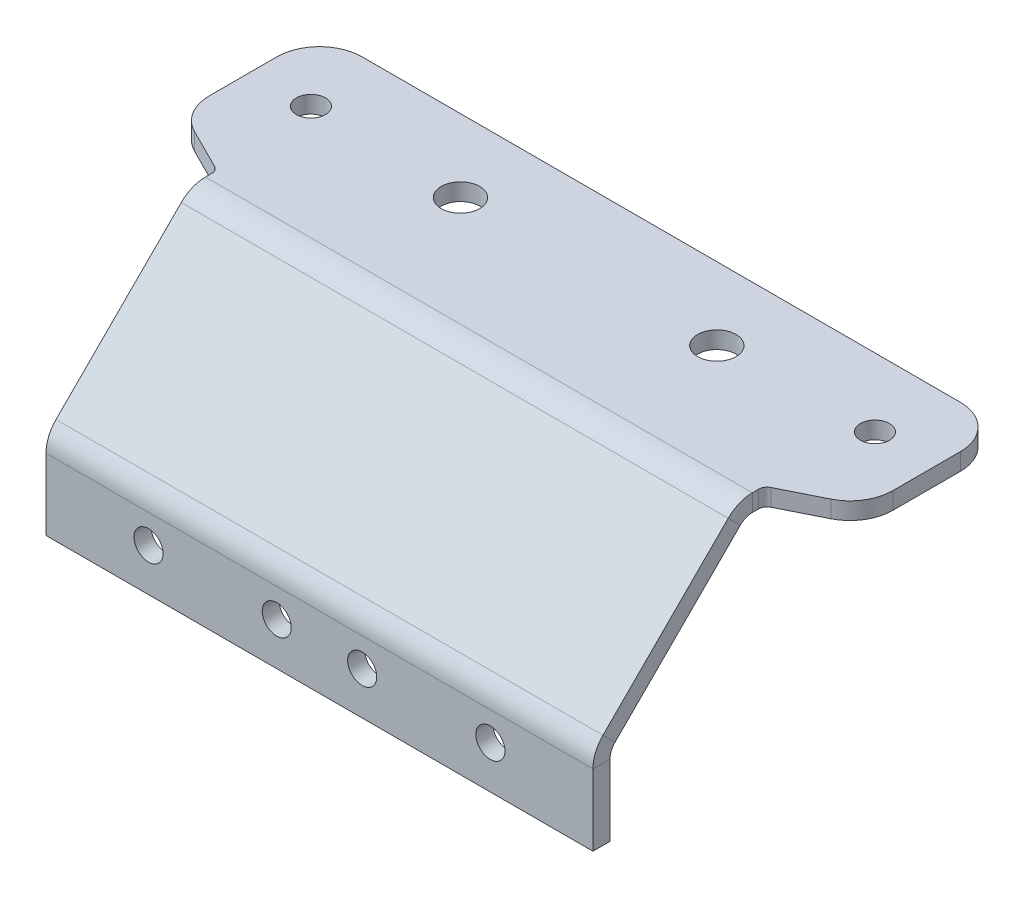
ISO-10303-21;
HEADER;
FILE_DESCRIPTION(('STEP AP214'),'2;1');
FILE_NAME('part.step','',(''),(''),'','','');
FILE_SCHEMA(('AUTOMOTIVE_DESIGN { 1 0 10303 214 1 1 1 1 }'));
ENDSEC;
DATA;
#1=APPLICATION_CONTEXT('core data for automotive mechanical design processes');
#2=APPLICATION_PROTOCOL_DEFINITION('international standard','automotive_design',2000,#1);
#3=PRODUCT_CONTEXT('',#1,'mechanical');
#4=PRODUCT('Part','Part','',(#3));
#5=PRODUCT_RELATED_PRODUCT_CATEGORY('part','',(#4));
#6=PRODUCT_DEFINITION_FORMATION('','',#4);
#7=PRODUCT_DEFINITION_CONTEXT('part definition',#1,'design');
#8=PRODUCT_DEFINITION('design','',#6,#7);
#9=PRODUCT_DEFINITION_SHAPE('','',#8);
#10=(LENGTH_UNIT() NAMED_UNIT(*) SI_UNIT(.MILLI.,.METRE.));
#11=(NAMED_UNIT(*) PLANE_ANGLE_UNIT() SI_UNIT($,.RADIAN.));
#12=(NAMED_UNIT(*) SI_UNIT($,.STERADIAN.) SOLID_ANGLE_UNIT());
#13=UNCERTAINTY_MEASURE_WITH_UNIT(LENGTH_MEASURE(1.E-05),#10,'distance_accuracy_value','');
#14=(GEOMETRIC_REPRESENTATION_CONTEXT(3) GLOBAL_UNCERTAINTY_ASSIGNED_CONTEXT((#13)) GLOBAL_UNIT_ASSIGNED_CONTEXT((#10,
#11,#12)) REPRESENTATION_CONTEXT('',''));
#15=CARTESIAN_POINT('',(0.,0.,0.));
#16=DIRECTION('',(0.,0.,1.));
#17=DIRECTION('',(1.,0.,0.));
#18=AXIS2_PLACEMENT_3D('',#15,#16,#17);
#19=CARTESIAN_POINT('',(80.,25.,-16.9999999999999));
#20=DIRECTION('',(0.,1.,0.));
#21=DIRECTION('',(0.,0.,1.));
#22=AXIS2_PLACEMENT_3D('',#19,#20,#21);
#23=PLANE('',#22);
#24=CARTESIAN_POINT('',(6.99999999999999,25.,-32.));
#25=DIRECTION('',(0.,1.,0.));
#26=DIRECTION('',(0.,0.,1.));
#27=AXIS2_PLACEMENT_3D('',#24,#25,#26);
#28=CIRCLE('',#27,1.7);
#29=CARTESIAN_POINT('',(6.99999999999999,25.,-30.3));
#30=VERTEX_POINT('',#29);
#31=EDGE_CURVE('E473',#30,#30,#28,.T.);
#32=ORIENTED_EDGE('',*,*,#31,.T.);
#33=EDGE_LOOP('',(#32));
#34=FACE_BOUND('',#33,.T.);
#35=CARTESIAN_POINT('',(73.,25.,-32.));
#36=DIRECTION('',(0.,1.,0.));
#37=DIRECTION('',(0.,0.,1.));
#38=AXIS2_PLACEMENT_3D('',#35,#36,#37);
#39=CIRCLE('',#38,1.69999999999999);
#40=CARTESIAN_POINT('',(73.,25.,-30.3));
#41=VERTEX_POINT('',#40);
#42=EDGE_CURVE('E467',#41,#41,#39,.T.);
#43=ORIENTED_EDGE('',*,*,#42,.T.);
#44=EDGE_LOOP('',(#43));
#45=FACE_BOUND('',#44,.T.);
#46=CARTESIAN_POINT('',(25.,25.,-31.5));
#47=DIRECTION('',(0.,1.,0.));
#48=DIRECTION('',(0.,0.,1.));
#49=AXIS2_PLACEMENT_3D('',#46,#47,#48);
#50=CIRCLE('',#49,2.25);
#51=CARTESIAN_POINT('',(25.,25.,-29.25));
#52=VERTEX_POINT('',#51);
#53=EDGE_CURVE('E461',#52,#52,#50,.T.);
#54=ORIENTED_EDGE('',*,*,#53,.T.);
#55=EDGE_LOOP('',(#54));
#56=FACE_BOUND('',#55,.T.);
#57=CARTESIAN_POINT('',(55.,25.,-31.5));
#58=DIRECTION('',(0.,1.,0.));
#59=DIRECTION('',(0.,0.,1.));
#60=AXIS2_PLACEMENT_3D('',#57,#58,#59);
#61=CIRCLE('',#60,2.25);
#62=CARTESIAN_POINT('',(55.,25.,-29.25));
#63=VERTEX_POINT('',#62);
#64=EDGE_CURVE('E455',#63,#63,#61,.T.);
#65=ORIENTED_EDGE('',*,*,#64,.T.);
#66=EDGE_LOOP('',(#65));
#67=FACE_BOUND('',#66,.T.);
#68=DIRECTION('',(0.,0.,-1.));
#69=VECTOR('',#68,1.);
#70=CARTESIAN_POINT('',(80.,25.,-16.9999999999999));
#71=LINE('',#70,#69);
#72=CARTESIAN_POINT('',(80.,25.,-27.0901699437495));
#73=VERTEX_POINT('',#72);
#74=CARTESIAN_POINT('',(80.,25.,-35.));
#75=VERTEX_POINT('',#74);
#76=EDGE_CURVE('E330',#73,#75,#71,.T.);
#77=ORIENTED_EDGE('',*,*,#76,.F.);
#78=CARTESIAN_POINT('',(75.,25.,-27.0901699437495));
#79=DIRECTION('',(0.,1.,0.));
#80=DIRECTION('',(0.,0.,1.));
#81=AXIS2_PLACEMENT_3D('',#78,#79,#80);
#82=CIRCLE('',#81,5.);
#83=CARTESIAN_POINT('',(77.2360679774998,25.,-22.6180339887499));
#84=VERTEX_POINT('',#83);
#85=EDGE_CURVE('E262',#73,#84,#82,.F.);
#86=ORIENTED_EDGE('',*,*,#85,.T.);
#87=DIRECTION('',(-0.894427190999916,0.,0.447213595499958));
#88=VECTOR('',#87,1.);
#89=CARTESIAN_POINT('',(77.2,25.,-22.6));
#90=LINE('',#89,#88);
#91=CARTESIAN_POINT('',(72.5527864045001,25.,-20.27639320225));
#92=VERTEX_POINT('',#91);
#93=EDGE_CURVE('E299',#84,#92,#90,.T.);
#94=ORIENTED_EDGE('',*,*,#93,.T.);
#95=CARTESIAN_POINT('',(73.,25.,-19.3819660112501));
#96=DIRECTION('',(0.,1.,0.));
#97=DIRECTION('',(0.,0.,1.));
#98=AXIS2_PLACEMENT_3D('',#95,#96,#97);
#99=CIRCLE('',#98,1.);
#100=CARTESIAN_POINT('',(72.,25.,-19.3819660112501));
#101=VERTEX_POINT('',#100);
#102=EDGE_CURVE('E289',#92,#101,#99,.T.);
#103=ORIENTED_EDGE('',*,*,#102,.T.);
#104=DIRECTION('',(0.,0.,1.));
#105=VECTOR('',#104,1.);
#106=CARTESIAN_POINT('',(72.,25.,-16.9999999999999));
#107=LINE('',#106,#105);
#108=CARTESIAN_POINT('',(72.,25.,-18.6568542494923));
#109=VERTEX_POINT('',#108);
#110=EDGE_CURVE('E296',#101,#109,#107,.T.);
#111=ORIENTED_EDGE('',*,*,#110,.T.);
#112=DIRECTION('',(-1.,0.,0.));
#113=VECTOR('',#112,1.);
#114=CARTESIAN_POINT('',(80.,25.,-18.6568542494923));
#115=LINE('',#114,#113);
#116=CARTESIAN_POINT('',(7.99999999999999,25.,-18.6568542494923));
#117=VERTEX_POINT('',#116);
#118=EDGE_CURVE('E337',#109,#117,#115,.T.);
#119=ORIENTED_EDGE('',*,*,#118,.T.);
#120=DIRECTION('',(0.,0.,-1.));
#121=VECTOR('',#120,1.);
#122=CARTESIAN_POINT('',(7.99999999999999,25.,-16.9999999999999));
#123=LINE('',#122,#121);
#124=CARTESIAN_POINT('',(7.99999999999999,25.,-19.3819660112501));
#125=VERTEX_POINT('',#124);
#126=EDGE_CURVE('E422',#117,#125,#123,.T.);
#127=ORIENTED_EDGE('',*,*,#126,.T.);
#128=CARTESIAN_POINT('',(6.99999999999999,25.,-19.3819660112501));
#129=DIRECTION('',(0.,1.,0.));
#130=DIRECTION('',(0.,0.,1.));
#131=AXIS2_PLACEMENT_3D('',#128,#129,#130);
#132=CIRCLE('',#131,1.);
#133=CARTESIAN_POINT('',(7.44721359549992,25.,-20.27639320225));
#134=VERTEX_POINT('',#133);
#135=EDGE_CURVE('E11',#125,#134,#132,.T.);
#136=ORIENTED_EDGE('',*,*,#135,.T.);
#137=DIRECTION('',(-0.894427190999916,0.,-0.447213595499958));
#138=VECTOR('',#137,1.);
#139=CARTESIAN_POINT('',(66.8,25.,9.40000000000003));
#140=LINE('',#139,#138);
#141=CARTESIAN_POINT('',(2.76393202250019,25.,-22.6180339887499));
#142=VERTEX_POINT('',#141);
#143=EDGE_CURVE('E425',#134,#142,#140,.T.);
#144=ORIENTED_EDGE('',*,*,#143,.T.);
#145=CARTESIAN_POINT('',(5.,25.,-27.0901699437495));
#146=DIRECTION('',(0.,1.,0.));
#147=DIRECTION('',(0.,0.,1.));
#148=AXIS2_PLACEMENT_3D('',#145,#146,#147);
#149=CIRCLE('',#148,5.);
#150=CARTESIAN_POINT('',(0.,25.,-27.0901699437495));
#151=VERTEX_POINT('',#150);
#152=EDGE_CURVE('E260',#142,#151,#149,.F.);
#153=ORIENTED_EDGE('',*,*,#152,.T.);
#154=DIRECTION('',(0.,0.,-1.));
#155=VECTOR('',#154,1.);
#156=CARTESIAN_POINT('',(0.,25.,-16.9999999999999));
#157=LINE('',#156,#155);
#158=CARTESIAN_POINT('',(0.,25.,-35.));
#159=VERTEX_POINT('',#158);
#160=EDGE_CURVE('E329',#151,#159,#157,.T.);
#161=ORIENTED_EDGE('',*,*,#160,.T.);
#162=CARTESIAN_POINT('',(5.,25.,-35.));
#163=DIRECTION('',(0.,1.,0.));
#164=DIRECTION('',(0.,0.,1.));
#165=AXIS2_PLACEMENT_3D('',#162,#163,#164);
#166=CIRCLE('',#165,5.);
#167=CARTESIAN_POINT('',(5.,25.,-40.));
#168=VERTEX_POINT('',#167);
#169=EDGE_CURVE('E258',#159,#168,#166,.F.);
#170=ORIENTED_EDGE('',*,*,#169,.T.);
#171=DIRECTION('',(-1.,0.,0.));
#172=VECTOR('',#171,1.);
#173=CARTESIAN_POINT('',(80.,25.,-40.));
#174=LINE('',#173,#172);
#175=CARTESIAN_POINT('',(75.,25.,-40.));
#176=VERTEX_POINT('',#175);
#177=EDGE_CURVE('E237',#176,#168,#174,.T.);
#178=ORIENTED_EDGE('',*,*,#177,.F.);
#179=CARTESIAN_POINT('',(75.,25.,-35.));
#180=DIRECTION('',(0.,1.,0.));
#181=DIRECTION('',(0.,0.,1.));
#182=AXIS2_PLACEMENT_3D('',#179,#180,#181);
#183=CIRCLE('',#182,5.);
#184=EDGE_CURVE('E256',#176,#75,#183,.F.);
#185=ORIENTED_EDGE('',*,*,#184,.T.);
#186=EDGE_LOOP('',(#77,#86,#94,#103,#111,#119,#127,#136,#144,#153,#161,#170,#178,#185));
#187=FACE_BOUND('',#186,.T.);
#188=ADVANCED_FACE('F38',(#34,#45,#56,#67,#187),#23,.F.);
#189=CARTESIAN_POINT('',(80.,27.,-16.9999999999999));
#190=DIRECTION('',(0.,1.,0.));
#191=DIRECTION('',(0.,0.,1.));
#192=AXIS2_PLACEMENT_3D('',#189,#190,#191);
#193=PLANE('',#192);
#194=CARTESIAN_POINT('',(6.99999999999999,27.,-32.));
#195=DIRECTION('',(0.,1.,0.));
#196=DIRECTION('',(0.,0.,1.));
#197=AXIS2_PLACEMENT_3D('',#194,#195,#196);
#198=CIRCLE('',#197,1.7);
#199=CARTESIAN_POINT('',(6.99999999999999,27.,-30.3));
#200=VERTEX_POINT('',#199);
#201=EDGE_CURVE('E476',#200,#200,#198,.T.);
#202=ORIENTED_EDGE('',*,*,#201,.F.);
#203=EDGE_LOOP('',(#202));
#204=FACE_BOUND('',#203,.T.);
#205=CARTESIAN_POINT('',(73.,27.,-32.));
#206=DIRECTION('',(0.,1.,0.));
#207=DIRECTION('',(0.,0.,1.));
#208=AXIS2_PLACEMENT_3D('',#205,#206,#207);
#209=CIRCLE('',#208,1.69999999999999);
#210=CARTESIAN_POINT('',(73.,27.,-30.3));
#211=VERTEX_POINT('',#210);
#212=EDGE_CURVE('E470',#211,#211,#209,.T.);
#213=ORIENTED_EDGE('',*,*,#212,.F.);
#214=EDGE_LOOP('',(#213));
#215=FACE_BOUND('',#214,.T.);
#216=CARTESIAN_POINT('',(25.,27.,-31.5));
#217=DIRECTION('',(0.,1.,0.));
#218=DIRECTION('',(0.,0.,1.));
#219=AXIS2_PLACEMENT_3D('',#216,#217,#218);
#220=CIRCLE('',#219,2.25);
#221=CARTESIAN_POINT('',(25.,27.,-29.25));
#222=VERTEX_POINT('',#221);
#223=EDGE_CURVE('E464',#222,#222,#220,.T.);
#224=ORIENTED_EDGE('',*,*,#223,.F.);
#225=EDGE_LOOP('',(#224));
#226=FACE_BOUND('',#225,.T.);
#227=CARTESIAN_POINT('',(55.,27.,-31.5));
#228=DIRECTION('',(0.,1.,0.));
#229=DIRECTION('',(0.,0.,1.));
#230=AXIS2_PLACEMENT_3D('',#227,#228,#229);
#231=CIRCLE('',#230,2.25);
#232=CARTESIAN_POINT('',(55.,27.,-29.25));
#233=VERTEX_POINT('',#232);
#234=EDGE_CURVE('E458',#233,#233,#231,.T.);
#235=ORIENTED_EDGE('',*,*,#234,.F.);
#236=EDGE_LOOP('',(#235));
#237=FACE_BOUND('',#236,.T.);
#238=DIRECTION('',(-0.894427190999916,0.,0.447213595499958));
#239=VECTOR('',#238,1.);
#240=CARTESIAN_POINT('',(77.2,27.,-22.6));
#241=LINE('',#240,#239);
#242=CARTESIAN_POINT('',(77.2360679774998,27.,-22.6180339887499));
#243=VERTEX_POINT('',#242);
#244=CARTESIAN_POINT('',(72.5527864045001,27.,-20.27639320225));
#245=VERTEX_POINT('',#244);
#246=EDGE_CURVE('E309',#243,#245,#241,.T.);
#247=ORIENTED_EDGE('',*,*,#246,.F.);
#248=CARTESIAN_POINT('',(75.,27.,-27.0901699437495));
#249=DIRECTION('',(0.,1.,0.));
#250=DIRECTION('',(0.,0.,1.));
#251=AXIS2_PLACEMENT_3D('',#248,#249,#250);
#252=CIRCLE('',#251,5.);
#253=CARTESIAN_POINT('',(80.,27.,-27.0901699437495));
#254=VERTEX_POINT('',#253);
#255=EDGE_CURVE('E250',#243,#254,#252,.T.);
#256=ORIENTED_EDGE('',*,*,#255,.T.);
#257=DIRECTION('',(0.,0.,-1.));
#258=VECTOR('',#257,1.);
#259=CARTESIAN_POINT('',(80.,27.,-16.9999999999999));
#260=LINE('',#259,#258);
#261=CARTESIAN_POINT('',(80.,27.,-35.));
#262=VERTEX_POINT('',#261);
#263=EDGE_CURVE('E333',#254,#262,#260,.T.);
#264=ORIENTED_EDGE('',*,*,#263,.T.);
#265=CARTESIAN_POINT('',(75.,27.,-35.));
#266=DIRECTION('',(0.,1.,0.));
#267=DIRECTION('',(0.,0.,1.));
#268=AXIS2_PLACEMENT_3D('',#265,#266,#267);
#269=CIRCLE('',#268,5.);
#270=CARTESIAN_POINT('',(75.,27.,-40.));
#271=VERTEX_POINT('',#270);
#272=EDGE_CURVE('E243',#262,#271,#269,.T.);
#273=ORIENTED_EDGE('',*,*,#272,.T.);
#274=DIRECTION('',(-1.,0.,0.));
#275=VECTOR('',#274,1.);
#276=CARTESIAN_POINT('',(80.,27.,-40.));
#277=LINE('',#276,#275);
#278=CARTESIAN_POINT('',(5.,27.,-40.));
#279=VERTEX_POINT('',#278);
#280=EDGE_CURVE('E234',#271,#279,#277,.T.);
#281=ORIENTED_EDGE('',*,*,#280,.T.);
#282=CARTESIAN_POINT('',(5.,27.,-35.));
#283=DIRECTION('',(0.,1.,0.));
#284=DIRECTION('',(0.,0.,1.));
#285=AXIS2_PLACEMENT_3D('',#282,#283,#284);
#286=CIRCLE('',#285,5.);
#287=CARTESIAN_POINT('',(0.,27.,-35.));
#288=VERTEX_POINT('',#287);
#289=EDGE_CURVE('E245',#279,#288,#286,.T.);
#290=ORIENTED_EDGE('',*,*,#289,.T.);
#291=DIRECTION('',(0.,0.,-1.));
#292=VECTOR('',#291,1.);
#293=CARTESIAN_POINT('',(0.,27.,-16.9999999999999));
#294=LINE('',#293,#292);
#295=CARTESIAN_POINT('',(0.,27.,-27.0901699437495));
#296=VERTEX_POINT('',#295);
#297=EDGE_CURVE('E334',#296,#288,#294,.T.);
#298=ORIENTED_EDGE('',*,*,#297,.F.);
#299=CARTESIAN_POINT('',(5.,27.,-27.0901699437495));
#300=DIRECTION('',(0.,1.,0.));
#301=DIRECTION('',(0.,0.,1.));
#302=AXIS2_PLACEMENT_3D('',#299,#300,#301);
#303=CIRCLE('',#302,5.);
#304=CARTESIAN_POINT('',(2.76393202250019,27.,-22.6180339887499));
#305=VERTEX_POINT('',#304);
#306=EDGE_CURVE('E247',#296,#305,#303,.T.);
#307=ORIENTED_EDGE('',*,*,#306,.T.);
#308=DIRECTION('',(-0.894427190999916,0.,-0.447213595499958));
#309=VECTOR('',#308,1.);
#310=CARTESIAN_POINT('',(66.8,27.,9.40000000000003));
#311=LINE('',#310,#309);
#312=CARTESIAN_POINT('',(7.44721359549992,27.,-20.27639320225));
#313=VERTEX_POINT('',#312);
#314=EDGE_CURVE('E421',#313,#305,#311,.T.);
#315=ORIENTED_EDGE('',*,*,#314,.F.);
#316=CARTESIAN_POINT('',(6.99999999999999,27.,-19.3819660112501));
#317=DIRECTION('',(0.,1.,0.));
#318=DIRECTION('',(0.,0.,1.));
#319=AXIS2_PLACEMENT_3D('',#316,#317,#318);
#320=CIRCLE('',#319,1.);
#321=CARTESIAN_POINT('',(7.99999999999999,27.,-19.3819660112501));
#322=VERTEX_POINT('',#321);
#323=EDGE_CURVE('E46',#313,#322,#320,.F.);
#324=ORIENTED_EDGE('',*,*,#323,.T.);
#325=DIRECTION('',(0.,0.,1.));
#326=VECTOR('',#325,1.);
#327=CARTESIAN_POINT('',(7.99999999999999,27.,-16.9999999999999));
#328=LINE('',#327,#326);
#329=CARTESIAN_POINT('',(7.99999999999999,27.,-18.6568542494923));
#330=VERTEX_POINT('',#329);
#331=EDGE_CURVE('E419',#330,#322,#328,.F.);
#332=ORIENTED_EDGE('',*,*,#331,.F.);
#333=DIRECTION('',(-1.,0.,0.));
#334=VECTOR('',#333,1.);
#335=CARTESIAN_POINT('',(80.,27.,-18.6568542494923));
#336=LINE('',#335,#334);
#337=CARTESIAN_POINT('',(72.,27.,-18.6568542494923));
#338=VERTEX_POINT('',#337);
#339=EDGE_CURVE('E226',#338,#330,#336,.T.);
#340=ORIENTED_EDGE('',*,*,#339,.F.);
#341=DIRECTION('',(0.,0.,1.));
#342=VECTOR('',#341,1.);
#343=CARTESIAN_POINT('',(72.,27.,-16.9999999999999));
#344=LINE('',#343,#342);
#345=CARTESIAN_POINT('',(72.,27.,-19.3819660112501));
#346=VERTEX_POINT('',#345);
#347=EDGE_CURVE('E316',#346,#338,#344,.T.);
#348=ORIENTED_EDGE('',*,*,#347,.F.);
#349=CARTESIAN_POINT('',(73.,27.,-19.3819660112501));
#350=DIRECTION('',(0.,1.,0.));
#351=DIRECTION('',(0.,0.,1.));
#352=AXIS2_PLACEMENT_3D('',#349,#350,#351);
#353=CIRCLE('',#352,1.);
#354=EDGE_CURVE('E287',#346,#245,#353,.F.);
#355=ORIENTED_EDGE('',*,*,#354,.T.);
#356=EDGE_LOOP('',(#247,#256,#264,#273,#281,#290,#298,#307,#315,#324,#332,#340,#348,#355));
#357=FACE_BOUND('',#356,.T.);
#358=ADVANCED_FACE('F314',(#204,#215,#226,#237,#357),#193,.T.);
#359=CARTESIAN_POINT('',(80.,23.,-18.6568542494923));
#360=DIRECTION('',(-1.,0.,0.));
#361=DIRECTION('',(0.,0.,1.));
#362=AXIS2_PLACEMENT_3D('',#359,#360,#361);
#363=CYLINDRICAL_SURFACE('',#362,4.);
#364=ORIENTED_EDGE('',*,*,#339,.T.);
#365=CARTESIAN_POINT('',(7.99999999999999,23.,-18.6568542494923));
#366=DIRECTION('',(1.,0.,0.));
#367=DIRECTION('',(0.,0.,-1.));
#368=AXIS2_PLACEMENT_3D('',#365,#366,#367);
#369=CIRCLE('',#368,4.);
#370=CARTESIAN_POINT('',(7.99999999999999,25.8284271247462,-15.8284271247461));
#371=VERTEX_POINT('',#370);
#372=EDGE_CURVE('E209',#371,#330,#369,.F.);
#373=ORIENTED_EDGE('',*,*,#372,.F.);
#374=DIRECTION('',(-1.,0.,0.));
#375=VECTOR('',#374,1.);
#376=CARTESIAN_POINT('',(80.,25.8284271247462,-15.8284271247461));
#377=LINE('',#376,#375);
#378=CARTESIAN_POINT('',(72.,25.8284271247462,-15.8284271247461));
#379=VERTEX_POINT('',#378);
#380=EDGE_CURVE('E218',#379,#371,#377,.T.);
#381=ORIENTED_EDGE('',*,*,#380,.F.);
#382=CARTESIAN_POINT('',(72.,23.,-18.6568542494923));
#383=DIRECTION('',(-1.,0.,0.));
#384=DIRECTION('',(0.,0.,1.));
#385=AXIS2_PLACEMENT_3D('',#382,#383,#384);
#386=CIRCLE('',#385,4.);
#387=EDGE_CURVE('E387',#338,#379,#386,.F.);
#388=ORIENTED_EDGE('',*,*,#387,.F.);
#389=EDGE_LOOP('',(#364,#373,#381,#388));
#390=FACE_BOUND('',#389,.T.);
#391=ADVANCED_FACE('F484',(#390),#363,.T.);
#392=CARTESIAN_POINT('',(80.,10.,0.));
#393=DIRECTION('',(0.,0.707106781186546,0.707106781186549));
#394=DIRECTION('',(0.,-0.707106781186549,0.707106781186546));
#395=AXIS2_PLACEMENT_3D('',#392,#393,#394);
#396=PLANE('',#395);
#397=ORIENTED_EDGE('',*,*,#380,.T.);
#398=DIRECTION('',(0.,0.707106781186549,-0.707106781186546));
#399=VECTOR('',#398,1.);
#400=CARTESIAN_POINT('',(7.99999999999999,10.,0.));
#401=LINE('',#400,#399);
#402=CARTESIAN_POINT('',(7.99999999999999,11.1715728752538,-1.1715728752538));
#403=VERTEX_POINT('',#402);
#404=EDGE_CURVE('E205',#403,#371,#401,.T.);
#405=ORIENTED_EDGE('',*,*,#404,.F.);
#406=DIRECTION('',(-1.,0.,0.));
#407=VECTOR('',#406,1.);
#408=CARTESIAN_POINT('',(80.,11.1715728752538,-1.1715728752538));
#409=LINE('',#408,#407);
#410=CARTESIAN_POINT('',(72.,11.1715728752538,-1.17157287525381));
#411=VERTEX_POINT('',#410);
#412=EDGE_CURVE('E216',#411,#403,#409,.T.);
#413=ORIENTED_EDGE('',*,*,#412,.F.);
#414=DIRECTION('',(0.,-0.707106781186549,0.707106781186546));
#415=VECTOR('',#414,1.);
#416=CARTESIAN_POINT('',(72.,10.,0.));
#417=LINE('',#416,#415);
#418=EDGE_CURVE('E392',#379,#411,#417,.T.);
#419=ORIENTED_EDGE('',*,*,#418,.F.);
#420=EDGE_LOOP('',(#397,#405,#413,#419));
#421=FACE_BOUND('',#420,.T.);
#422=ADVANCED_FACE('F214',(#421),#396,.T.);
#423=CARTESIAN_POINT('',(80.,8.34314575050763,-4.));
#424=DIRECTION('',(-1.,0.,0.));
#425=DIRECTION('',(0.,0.,1.));
#426=AXIS2_PLACEMENT_3D('',#423,#424,#425);
#427=CYLINDRICAL_SURFACE('',#426,4.);
#428=ORIENTED_EDGE('',*,*,#412,.T.);
#429=CARTESIAN_POINT('',(7.99999999999999,8.34314575050763,-4.));
#430=DIRECTION('',(1.,0.,0.));
#431=DIRECTION('',(0.,0.,-1.));
#432=AXIS2_PLACEMENT_3D('',#429,#430,#431);
#433=CIRCLE('',#432,4.);
#434=CARTESIAN_POINT('',(7.99999999999999,8.34314575050763,0.));
#435=VERTEX_POINT('',#434);
#436=EDGE_CURVE('E187',#435,#403,#433,.F.);
#437=ORIENTED_EDGE('',*,*,#436,.F.);
#438=DIRECTION('',(-1.,0.,0.));
#439=VECTOR('',#438,1.);
#440=CARTESIAN_POINT('',(80.,8.34314575050763,0.));
#441=LINE('',#440,#439);
#442=CARTESIAN_POINT('',(72.,8.34314575050763,0.));
#443=VERTEX_POINT('',#442);
#444=EDGE_CURVE('E224',#443,#435,#441,.T.);
#445=ORIENTED_EDGE('',*,*,#444,.F.);
#446=CARTESIAN_POINT('',(72.,8.34314575050763,-4.));
#447=DIRECTION('',(-1.,0.,0.));
#448=DIRECTION('',(0.,0.,1.));
#449=AXIS2_PLACEMENT_3D('',#446,#447,#448);
#450=CIRCLE('',#449,4.);
#451=EDGE_CURVE('E223',#411,#443,#450,.F.);
#452=ORIENTED_EDGE('',*,*,#451,.F.);
#453=EDGE_LOOP('',(#428,#437,#445,#452));
#454=FACE_BOUND('',#453,.T.);
#455=ADVANCED_FACE('F222',(#454),#427,.T.);
#456=CARTESIAN_POINT('',(80.,0.,0.));
#457=DIRECTION('',(0.,0.,1.));
#458=DIRECTION('',(1.,0.,0.));
#459=AXIS2_PLACEMENT_3D('',#456,#457,#458);
#460=PLANE('',#459);
#461=CARTESIAN_POINT('',(20.,5.,0.));
#462=DIRECTION('',(0.,0.,1.));
#463=DIRECTION('',(1.,0.,0.));
#464=AXIS2_PLACEMENT_3D('',#461,#462,#463);
#465=CIRCLE('',#464,1.7);
#466=CARTESIAN_POINT('',(21.7,5.,0.));
#467=VERTEX_POINT('',#466);
#468=EDGE_CURVE('E452',#467,#467,#465,.T.);
#469=ORIENTED_EDGE('',*,*,#468,.F.);
#470=EDGE_LOOP('',(#469));
#471=FACE_BOUND('',#470,.T.);
#472=CARTESIAN_POINT('',(35.,5.,0.));
#473=DIRECTION('',(0.,0.,1.));
#474=DIRECTION('',(1.,0.,0.));
#475=AXIS2_PLACEMENT_3D('',#472,#473,#474);
#476=CIRCLE('',#475,1.7);
#477=CARTESIAN_POINT('',(36.7,5.,0.));
#478=VERTEX_POINT('',#477);
#479=EDGE_CURVE('E446',#478,#478,#476,.T.);
#480=ORIENTED_EDGE('',*,*,#479,.F.);
#481=EDGE_LOOP('',(#480));
#482=FACE_BOUND('',#481,.T.);
#483=CARTESIAN_POINT('',(45.,5.,0.));
#484=DIRECTION('',(0.,0.,1.));
#485=DIRECTION('',(1.,0.,0.));
#486=AXIS2_PLACEMENT_3D('',#483,#484,#485);
#487=CIRCLE('',#486,1.7);
#488=CARTESIAN_POINT('',(46.7,5.,0.));
#489=VERTEX_POINT('',#488);
#490=EDGE_CURVE('E440',#489,#489,#487,.T.);
#491=ORIENTED_EDGE('',*,*,#490,.F.);
#492=EDGE_LOOP('',(#491));
#493=FACE_BOUND('',#492,.T.);
#494=CARTESIAN_POINT('',(60.,5.,0.));
#495=DIRECTION('',(0.,0.,1.));
#496=DIRECTION('',(1.,0.,0.));
#497=AXIS2_PLACEMENT_3D('',#494,#495,#496);
#498=CIRCLE('',#497,1.7);
#499=CARTESIAN_POINT('',(61.7,5.,0.));
#500=VERTEX_POINT('',#499);
#501=EDGE_CURVE('E434',#500,#500,#498,.T.);
#502=ORIENTED_EDGE('',*,*,#501,.F.);
#503=EDGE_LOOP('',(#502));
#504=FACE_BOUND('',#503,.T.);
#505=ORIENTED_EDGE('',*,*,#444,.T.);
#506=DIRECTION('',(0.,1.,0.));
#507=VECTOR('',#506,1.);
#508=CARTESIAN_POINT('',(7.99999999999999,0.,0.));
#509=LINE('',#508,#507);
#510=CARTESIAN_POINT('',(7.99999999999999,0.,0.));
#511=VERTEX_POINT('',#510);
#512=EDGE_CURVE('E367',#511,#435,#509,.T.);
#513=ORIENTED_EDGE('',*,*,#512,.F.);
#514=DIRECTION('',(-1.,0.,0.));
#515=VECTOR('',#514,1.);
#516=CARTESIAN_POINT('',(80.,0.,0.));
#517=LINE('',#516,#515);
#518=CARTESIAN_POINT('',(72.,0.,0.));
#519=VERTEX_POINT('',#518);
#520=EDGE_CURVE('E228',#519,#511,#517,.T.);
#521=ORIENTED_EDGE('',*,*,#520,.F.);
#522=DIRECTION('',(0.,1.,0.));
#523=VECTOR('',#522,1.);
#524=CARTESIAN_POINT('',(72.,0.,0.));
#525=LINE('',#524,#523);
#526=EDGE_CURVE('E366',#443,#519,#525,.F.);
#527=ORIENTED_EDGE('',*,*,#526,.F.);
#528=EDGE_LOOP('',(#505,#513,#521,#527));
#529=FACE_BOUND('',#528,.T.);
#530=ADVANCED_FACE('F365',(#471,#482,#493,#504,#529),#460,.T.);
#531=CARTESIAN_POINT('',(80.,0.,-2.));
#532=DIRECTION('',(0.,-1.,0.));
#533=DIRECTION('',(0.,0.,-1.));
#534=AXIS2_PLACEMENT_3D('',#531,#532,#533);
#535=PLANE('',#534);
#536=ORIENTED_EDGE('',*,*,#520,.T.);
#537=DIRECTION('',(0.,0.,1.));
#538=VECTOR('',#537,1.);
#539=CARTESIAN_POINT('',(7.99999999999999,0.,0.));
#540=LINE('',#539,#538);
#541=CARTESIAN_POINT('',(7.99999999999999,0.,-2.));
#542=VERTEX_POINT('',#541);
#543=EDGE_CURVE('E219',#511,#542,#540,.F.);
#544=ORIENTED_EDGE('',*,*,#543,.T.);
#545=DIRECTION('',(-1.,0.,0.));
#546=VECTOR('',#545,1.);
#547=CARTESIAN_POINT('',(80.,0.,-2.));
#548=LINE('',#547,#546);
#549=CARTESIAN_POINT('',(72.,0.,-2.));
#550=VERTEX_POINT('',#549);
#551=EDGE_CURVE('E352',#550,#542,#548,.T.);
#552=ORIENTED_EDGE('',*,*,#551,.F.);
#553=DIRECTION('',(0.,0.,-1.));
#554=VECTOR('',#553,1.);
#555=CARTESIAN_POINT('',(72.,0.,-2.));
#556=LINE('',#555,#554);
#557=EDGE_CURVE('E361',#550,#519,#556,.F.);
#558=ORIENTED_EDGE('',*,*,#557,.T.);
#559=EDGE_LOOP('',(#536,#544,#552,#558));
#560=FACE_BOUND('',#559,.T.);
#561=ADVANCED_FACE('F359',(#560),#535,.T.);
#562=CARTESIAN_POINT('',(80.,0.,-2.));
#563=DIRECTION('',(0.,0.,1.));
#564=DIRECTION('',(1.,0.,0.));
#565=AXIS2_PLACEMENT_3D('',#562,#563,#564);
#566=PLANE('',#565);
#567=CARTESIAN_POINT('',(20.,5.,-2.));
#568=DIRECTION('',(0.,0.,1.));
#569=DIRECTION('',(1.,0.,0.));
#570=AXIS2_PLACEMENT_3D('',#567,#568,#569);
#571=CIRCLE('',#570,1.7);
#572=CARTESIAN_POINT('',(21.7,5.,-2.));
#573=VERTEX_POINT('',#572);
#574=EDGE_CURVE('E449',#573,#573,#571,.T.);
#575=ORIENTED_EDGE('',*,*,#574,.T.);
#576=EDGE_LOOP('',(#575));
#577=FACE_BOUND('',#576,.T.);
#578=CARTESIAN_POINT('',(35.,5.,-2.));
#579=DIRECTION('',(0.,0.,1.));
#580=DIRECTION('',(1.,0.,0.));
#581=AXIS2_PLACEMENT_3D('',#578,#579,#580);
#582=CIRCLE('',#581,1.7);
#583=CARTESIAN_POINT('',(36.7,5.,-2.));
#584=VERTEX_POINT('',#583);
#585=EDGE_CURVE('E443',#584,#584,#582,.T.);
#586=ORIENTED_EDGE('',*,*,#585,.T.);
#587=EDGE_LOOP('',(#586));
#588=FACE_BOUND('',#587,.T.);
#589=CARTESIAN_POINT('',(45.,5.,-2.));
#590=DIRECTION('',(0.,0.,1.));
#591=DIRECTION('',(1.,0.,0.));
#592=AXIS2_PLACEMENT_3D('',#589,#590,#591);
#593=CIRCLE('',#592,1.7);
#594=CARTESIAN_POINT('',(46.7,5.,-2.));
#595=VERTEX_POINT('',#594);
#596=EDGE_CURVE('E437',#595,#595,#593,.T.);
#597=ORIENTED_EDGE('',*,*,#596,.T.);
#598=EDGE_LOOP('',(#597));
#599=FACE_BOUND('',#598,.T.);
#600=CARTESIAN_POINT('',(60.,5.,-2.));
#601=DIRECTION('',(0.,0.,1.));
#602=DIRECTION('',(1.,0.,0.));
#603=AXIS2_PLACEMENT_3D('',#600,#601,#602);
#604=CIRCLE('',#603,1.7);
#605=CARTESIAN_POINT('',(61.7,5.,-2.));
#606=VERTEX_POINT('',#605);
#607=EDGE_CURVE('E427',#606,#606,#604,.T.);
#608=ORIENTED_EDGE('',*,*,#607,.T.);
#609=EDGE_LOOP('',(#608));
#610=FACE_BOUND('',#609,.T.);
#611=DIRECTION('',(0.,1.,0.));
#612=VECTOR('',#611,1.);
#613=CARTESIAN_POINT('',(7.99999999999999,0.,-2.));
#614=LINE('',#613,#612);
#615=CARTESIAN_POINT('',(7.99999999999999,8.34314575050763,-2.));
#616=VERTEX_POINT('',#615);
#617=EDGE_CURVE('E369',#542,#616,#614,.T.);
#618=ORIENTED_EDGE('',*,*,#617,.T.);
#619=DIRECTION('',(-1.,0.,0.));
#620=VECTOR('',#619,1.);
#621=CARTESIAN_POINT('',(80.,8.34314575050763,-2.));
#622=LINE('',#621,#620);
#623=CARTESIAN_POINT('',(72.,8.34314575050763,-2.));
#624=VERTEX_POINT('',#623);
#625=EDGE_CURVE('E349',#624,#616,#622,.T.);
#626=ORIENTED_EDGE('',*,*,#625,.F.);
#627=DIRECTION('',(0.,-1.,0.));
#628=VECTOR('',#627,1.);
#629=CARTESIAN_POINT('',(72.,0.,-2.));
#630=LINE('',#629,#628);
#631=EDGE_CURVE('E386',#624,#550,#630,.T.);
#632=ORIENTED_EDGE('',*,*,#631,.T.);
#633=ORIENTED_EDGE('',*,*,#551,.T.);
#634=EDGE_LOOP('',(#618,#626,#632,#633));
#635=FACE_BOUND('',#634,.T.);
#636=ADVANCED_FACE('F416',(#577,#588,#599,#610,#635),#566,.F.);
#637=CARTESIAN_POINT('',(80.,8.34314575050763,-4.));
#638=DIRECTION('',(-1.,0.,0.));
#639=DIRECTION('',(0.,0.,1.));
#640=AXIS2_PLACEMENT_3D('',#637,#638,#639);
#641=CYLINDRICAL_SURFACE('',#640,2.);
#642=CARTESIAN_POINT('',(7.99999999999999,8.34314575050763,-4.));
#643=DIRECTION('',(-1.,0.,0.));
#644=DIRECTION('',(0.,0.,1.));
#645=AXIS2_PLACEMENT_3D('',#642,#643,#644);
#646=CIRCLE('',#645,2.);
#647=CARTESIAN_POINT('',(7.99999999999999,9.75735931288072,-2.5857864376269));
#648=VERTEX_POINT('',#647);
#649=EDGE_CURVE('E199',#616,#648,#646,.T.);
#650=ORIENTED_EDGE('',*,*,#649,.T.);
#651=DIRECTION('',(-1.,0.,0.));
#652=VECTOR('',#651,1.);
#653=CARTESIAN_POINT('',(80.,9.75735931288072,-2.5857864376269));
#654=LINE('',#653,#652);
#655=CARTESIAN_POINT('',(72.,9.75735931288072,-2.5857864376269));
#656=VERTEX_POINT('',#655);
#657=EDGE_CURVE('E346',#656,#648,#654,.T.);
#658=ORIENTED_EDGE('',*,*,#657,.F.);
#659=CARTESIAN_POINT('',(72.,8.34314575050763,-4.));
#660=DIRECTION('',(-1.,0.,0.));
#661=DIRECTION('',(0.,0.,1.));
#662=AXIS2_PLACEMENT_3D('',#659,#660,#661);
#663=CIRCLE('',#662,2.);
#664=EDGE_CURVE('E198',#656,#624,#663,.F.);
#665=ORIENTED_EDGE('',*,*,#664,.T.);
#666=ORIENTED_EDGE('',*,*,#625,.T.);
#667=EDGE_LOOP('',(#650,#658,#665,#666));
#668=FACE_BOUND('',#667,.T.);
#669=ADVANCED_FACE('F414',(#668),#641,.F.);
#670=CARTESIAN_POINT('',(80.,8.58578643762691,-1.4142135623731));
#671=DIRECTION('',(0.,0.707106781186546,0.707106781186549));
#672=DIRECTION('',(0.,-0.707106781186549,0.707106781186546));
#673=AXIS2_PLACEMENT_3D('',#670,#671,#672);
#674=PLANE('',#673);
#675=DIRECTION('',(0.,-0.707106781186549,0.707106781186546));
#676=VECTOR('',#675,1.);
#677=CARTESIAN_POINT('',(7.99999999999999,8.58578643762691,-1.4142135623731));
#678=LINE('',#677,#676);
#679=CARTESIAN_POINT('',(7.99999999999999,24.4142135623731,-17.2426406871192));
#680=VERTEX_POINT('',#679);
#681=EDGE_CURVE('E208',#648,#680,#678,.F.);
#682=ORIENTED_EDGE('',*,*,#681,.T.);
#683=DIRECTION('',(-1.,0.,0.));
#684=VECTOR('',#683,1.);
#685=CARTESIAN_POINT('',(80.,24.4142135623731,-17.2426406871192));
#686=LINE('',#685,#684);
#687=CARTESIAN_POINT('',(72.,24.4142135623731,-17.2426406871192));
#688=VERTEX_POINT('',#687);
#689=EDGE_CURVE('E343',#688,#680,#686,.T.);
#690=ORIENTED_EDGE('',*,*,#689,.F.);
#691=DIRECTION('',(0.,-0.707106781186549,0.707106781186546));
#692=VECTOR('',#691,1.);
#693=CARTESIAN_POINT('',(72.,8.58578643762691,-1.4142135623731));
#694=LINE('',#693,#692);
#695=EDGE_CURVE('E395',#688,#656,#694,.T.);
#696=ORIENTED_EDGE('',*,*,#695,.T.);
#697=ORIENTED_EDGE('',*,*,#657,.T.);
#698=EDGE_LOOP('',(#682,#690,#696,#697));
#699=FACE_BOUND('',#698,.T.);
#700=ADVANCED_FACE('F584',(#699),#674,.F.);
#701=CARTESIAN_POINT('',(80.,23.,-18.6568542494923));
#702=DIRECTION('',(-1.,0.,0.));
#703=DIRECTION('',(0.,0.,1.));
#704=AXIS2_PLACEMENT_3D('',#701,#702,#703);
#705=CYLINDRICAL_SURFACE('',#704,2.);
#706=CARTESIAN_POINT('',(7.99999999999999,23.,-18.6568542494923));
#707=DIRECTION('',(-1.,0.,0.));
#708=DIRECTION('',(0.,0.,1.));
#709=AXIS2_PLACEMENT_3D('',#706,#707,#708);
#710=CIRCLE('',#709,2.);
#711=EDGE_CURVE('E379',#680,#117,#710,.T.);
#712=ORIENTED_EDGE('',*,*,#711,.T.);
#713=ORIENTED_EDGE('',*,*,#118,.F.);
#714=CARTESIAN_POINT('',(72.,23.,-18.6568542494923));
#715=DIRECTION('',(-1.,0.,0.));
#716=DIRECTION('',(0.,0.,1.));
#717=AXIS2_PLACEMENT_3D('',#714,#715,#716);
#718=CIRCLE('',#717,2.);
#719=EDGE_CURVE('E383',#109,#688,#718,.F.);
#720=ORIENTED_EDGE('',*,*,#719,.T.);
#721=ORIENTED_EDGE('',*,*,#689,.T.);
#722=EDGE_LOOP('',(#712,#713,#720,#721));
#723=FACE_BOUND('',#722,.T.);
#724=ADVANCED_FACE('F581',(#723),#705,.F.);
#725=CARTESIAN_POINT('',(0.,23.,-18.6568542494923));
#726=DIRECTION('',(1.,0.,0.));
#727=DIRECTION('',(0.,0.,-1.));
#728=AXIS2_PLACEMENT_3D('',#725,#726,#727);
#729=PLANE('',#728);
#730=ORIENTED_EDGE('',*,*,#160,.F.);
#731=DIRECTION('',(0.,-1.,0.));
#732=VECTOR('',#731,1.);
#733=CARTESIAN_POINT('',(0.,27.,-27.0901699437495));
#734=LINE('',#733,#732);
#735=EDGE_CURVE('E267',#151,#296,#734,.F.);
#736=ORIENTED_EDGE('',*,*,#735,.T.);
#737=ORIENTED_EDGE('',*,*,#297,.T.);
#738=DIRECTION('',(0.,-1.,0.));
#739=VECTOR('',#738,1.);
#740=CARTESIAN_POINT('',(0.,25.,-35.));
#741=LINE('',#740,#739);
#742=EDGE_CURVE('E264',#288,#159,#741,.T.);
#743=ORIENTED_EDGE('',*,*,#742,.T.);
#744=EDGE_LOOP('',(#730,#736,#737,#743));
#745=FACE_BOUND('',#744,.T.);
#746=ADVANCED_FACE('F521',(#745),#729,.F.);
#747=CARTESIAN_POINT('',(80.,24.4142135623731,-17.2426406871192));
#748=DIRECTION('',(1.,0.,0.));
#749=DIRECTION('',(0.,0.,-1.));
#750=AXIS2_PLACEMENT_3D('',#747,#748,#749);
#751=PLANE('',#750);
#752=ORIENTED_EDGE('',*,*,#263,.F.);
#753=DIRECTION('',(0.,-1.,0.));
#754=VECTOR('',#753,1.);
#755=CARTESIAN_POINT('',(80.,24.4142135623731,-27.0901699437495));
#756=LINE('',#755,#754);
#757=EDGE_CURVE('E254',#254,#73,#756,.T.);
#758=ORIENTED_EDGE('',*,*,#757,.T.);
#759=ORIENTED_EDGE('',*,*,#76,.T.);
#760=DIRECTION('',(0.,-1.,0.));
#761=VECTOR('',#760,1.);
#762=CARTESIAN_POINT('',(80.,24.4142135623731,-35.));
#763=LINE('',#762,#761);
#764=EDGE_CURVE('E252',#75,#262,#763,.F.);
#765=ORIENTED_EDGE('',*,*,#764,.T.);
#766=EDGE_LOOP('',(#752,#758,#759,#765));
#767=FACE_BOUND('',#766,.T.);
#768=ADVANCED_FACE('F518',(#767),#751,.T.);
#769=CARTESIAN_POINT('',(80.,27.,-40.));
#770=DIRECTION('',(0.,0.,-1.));
#771=DIRECTION('',(-1.,0.,0.));
#772=AXIS2_PLACEMENT_3D('',#769,#770,#771);
#773=PLANE('',#772);
#774=ORIENTED_EDGE('',*,*,#177,.T.);
#775=DIRECTION('',(0.,-1.,0.));
#776=VECTOR('',#775,1.);
#777=CARTESIAN_POINT('',(5.,27.,-40.));
#778=LINE('',#777,#776);
#779=EDGE_CURVE('E276',#168,#279,#778,.F.);
#780=ORIENTED_EDGE('',*,*,#779,.T.);
#781=ORIENTED_EDGE('',*,*,#280,.F.);
#782=DIRECTION('',(0.,-1.,0.));
#783=VECTOR('',#782,1.);
#784=CARTESIAN_POINT('',(75.,27.,-40.));
#785=LINE('',#784,#783);
#786=EDGE_CURVE('E273',#271,#176,#785,.T.);
#787=ORIENTED_EDGE('',*,*,#786,.T.);
#788=EDGE_LOOP('',(#774,#780,#781,#787));
#789=FACE_BOUND('',#788,.T.);
#790=ADVANCED_FACE('F517',(#789),#773,.T.);
#791=CARTESIAN_POINT('',(72.,25.,-16.9999999999999));
#792=DIRECTION('',(-1.,0.,0.));
#793=DIRECTION('',(0.,0.,1.));
#794=AXIS2_PLACEMENT_3D('',#791,#792,#793);
#795=PLANE('',#794);
#796=ORIENTED_EDGE('',*,*,#110,.F.);
#797=DIRECTION('',(0.,-1.,0.));
#798=VECTOR('',#797,1.);
#799=CARTESIAN_POINT('',(72.,27.,-19.3819660112501));
#800=LINE('',#799,#798);
#801=EDGE_CURVE('E278',#101,#346,#800,.F.);
#802=ORIENTED_EDGE('',*,*,#801,.T.);
#803=ORIENTED_EDGE('',*,*,#347,.T.);
#804=DIRECTION('',(0.,-1.,0.));
#805=VECTOR('',#804,1.);
#806=CARTESIAN_POINT('',(72.,25.,-18.6568542494923));
#807=LINE('',#806,#805);
#808=EDGE_CURVE('E307',#109,#338,#807,.F.);
#809=ORIENTED_EDGE('',*,*,#808,.F.);
#810=EDGE_LOOP('',(#796,#802,#803,#809));
#811=FACE_BOUND('',#810,.T.);
#812=ADVANCED_FACE('F304',(#811),#795,.F.);
#813=CARTESIAN_POINT('',(77.2,25.,-22.6));
#814=DIRECTION('',(-0.447213595499958,0.,-0.894427190999916));
#815=DIRECTION('',(-0.894427190999916,0.,0.447213595499958));
#816=AXIS2_PLACEMENT_3D('',#813,#814,#815);
#817=PLANE('',#816);
#818=ORIENTED_EDGE('',*,*,#246,.T.);
#819=DIRECTION('',(0.,-1.,0.));
#820=VECTOR('',#819,1.);
#821=CARTESIAN_POINT('',(72.5527864045001,25.,-20.27639320225));
#822=LINE('',#821,#820);
#823=EDGE_CURVE('E281',#245,#92,#822,.T.);
#824=ORIENTED_EDGE('',*,*,#823,.T.);
#825=ORIENTED_EDGE('',*,*,#93,.F.);
#826=DIRECTION('',(0.,1.,0.));
#827=VECTOR('',#826,1.);
#828=CARTESIAN_POINT('',(77.2360679774998,25.,-22.6180339887499));
#829=LINE('',#828,#827);
#830=EDGE_CURVE('E240',#84,#243,#829,.T.);
#831=ORIENTED_EDGE('',*,*,#830,.T.);
#832=EDGE_LOOP('',(#818,#824,#825,#831));
#833=FACE_BOUND('',#832,.T.);
#834=ADVANCED_FACE('F318',(#833),#817,.F.);
#835=CARTESIAN_POINT('',(72.,0.,-2.));
#836=DIRECTION('',(-1.,0.,0.));
#837=DIRECTION('',(0.,-1.,0.));
#838=AXIS2_PLACEMENT_3D('',#835,#836,#837);
#839=PLANE('',#838);
#840=ORIENTED_EDGE('',*,*,#557,.F.);
#841=ORIENTED_EDGE('',*,*,#631,.F.);
#842=DIRECTION('',(0.,0.,-1.));
#843=VECTOR('',#842,1.);
#844=CARTESIAN_POINT('',(72.,8.34314575050763,-2.));
#845=LINE('',#844,#843);
#846=EDGE_CURVE('E323',#624,#443,#845,.F.);
#847=ORIENTED_EDGE('',*,*,#846,.T.);
#848=ORIENTED_EDGE('',*,*,#526,.T.);
#849=EDGE_LOOP('',(#840,#841,#847,#848));
#850=FACE_BOUND('',#849,.T.);
#851=ADVANCED_FACE('F407',(#850),#839,.F.);
#852=CARTESIAN_POINT('',(72.,8.34314575050763,-4.));
#853=DIRECTION('',(1.,0.,0.));
#854=DIRECTION('',(0.,0.,-1.));
#855=AXIS2_PLACEMENT_3D('',#852,#853,#854);
#856=PLANE('',#855);
#857=ORIENTED_EDGE('',*,*,#846,.F.);
#858=ORIENTED_EDGE('',*,*,#664,.F.);
#859=DIRECTION('',(0.,-0.707106781186546,-0.707106781186549));
#860=VECTOR('',#859,1.);
#861=CARTESIAN_POINT('',(72.,9.75735931288072,-2.5857864376269));
#862=LINE('',#861,#860);
#863=EDGE_CURVE('E326',#656,#411,#862,.F.);
#864=ORIENTED_EDGE('',*,*,#863,.T.);
#865=ORIENTED_EDGE('',*,*,#451,.T.);
#866=EDGE_LOOP('',(#857,#858,#864,#865));
#867=FACE_BOUND('',#866,.T.);
#868=ADVANCED_FACE('F410',(#867),#856,.T.);
#869=CARTESIAN_POINT('',(72.,8.58578643762691,-1.4142135623731));
#870=DIRECTION('',(-1.,0.,0.));
#871=DIRECTION('',(0.,-0.707106781186549,0.707106781186546));
#872=AXIS2_PLACEMENT_3D('',#869,#870,#871);
#873=PLANE('',#872);
#874=ORIENTED_EDGE('',*,*,#863,.F.);
#875=ORIENTED_EDGE('',*,*,#695,.F.);
#876=DIRECTION('',(0.,-0.707106781186546,-0.707106781186549));
#877=VECTOR('',#876,1.);
#878=CARTESIAN_POINT('',(72.,24.4142135623731,-17.2426406871192));
#879=LINE('',#878,#877);
#880=EDGE_CURVE('E394',#688,#379,#879,.F.);
#881=ORIENTED_EDGE('',*,*,#880,.T.);
#882=ORIENTED_EDGE('',*,*,#418,.T.);
#883=EDGE_LOOP('',(#874,#875,#881,#882));
#884=FACE_BOUND('',#883,.T.);
#885=ADVANCED_FACE('F617',(#884),#873,.F.);
#886=CARTESIAN_POINT('',(72.,23.,-18.6568542494923));
#887=DIRECTION('',(1.,0.,0.));
#888=DIRECTION('',(0.,0.,-1.));
#889=AXIS2_PLACEMENT_3D('',#886,#887,#888);
#890=PLANE('',#889);
#891=ORIENTED_EDGE('',*,*,#387,.T.);
#892=ORIENTED_EDGE('',*,*,#880,.F.);
#893=ORIENTED_EDGE('',*,*,#719,.F.);
#894=ORIENTED_EDGE('',*,*,#808,.T.);
#895=EDGE_LOOP('',(#891,#892,#893,#894));
#896=FACE_BOUND('',#895,.T.);
#897=ADVANCED_FACE('F619',(#896),#890,.T.);
#898=CARTESIAN_POINT('',(66.8,25.,9.40000000000003));
#899=DIRECTION('',(0.447213595499958,0.,-0.894427190999916));
#900=DIRECTION('',(-0.894427190999916,0.,-0.447213595499958));
#901=AXIS2_PLACEMENT_3D('',#898,#899,#900);
#902=PLANE('',#901);
#903=ORIENTED_EDGE('',*,*,#143,.F.);
#904=DIRECTION('',(0.,-1.,0.));
#905=VECTOR('',#904,1.);
#906=CARTESIAN_POINT('',(7.44721359549995,27.,-20.27639320225));
#907=LINE('',#906,#905);
#908=EDGE_CURVE('E283',#134,#313,#907,.F.);
#909=ORIENTED_EDGE('',*,*,#908,.T.);
#910=ORIENTED_EDGE('',*,*,#314,.T.);
#911=DIRECTION('',(0.,1.,0.));
#912=VECTOR('',#911,1.);
#913=CARTESIAN_POINT('',(2.76393202250021,25.,-22.6180339887499));
#914=LINE('',#913,#912);
#915=EDGE_CURVE('E270',#305,#142,#914,.F.);
#916=ORIENTED_EDGE('',*,*,#915,.T.);
#917=EDGE_LOOP('',(#903,#909,#910,#916));
#918=FACE_BOUND('',#917,.T.);
#919=ADVANCED_FACE('F549',(#918),#902,.F.);
#920=CARTESIAN_POINT('',(7.99999999999999,25.,-16.9999999999999));
#921=DIRECTION('',(1.,0.,0.));
#922=DIRECTION('',(0.,0.,-1.));
#923=AXIS2_PLACEMENT_3D('',#920,#921,#922);
#924=PLANE('',#923);
#925=ORIENTED_EDGE('',*,*,#331,.T.);
#926=DIRECTION('',(0.,-1.,0.));
#927=VECTOR('',#926,1.);
#928=CARTESIAN_POINT('',(7.99999999999999,25.,-19.3819660112501));
#929=LINE('',#928,#927);
#930=EDGE_CURVE('E59',#322,#125,#929,.T.);
#931=ORIENTED_EDGE('',*,*,#930,.T.);
#932=ORIENTED_EDGE('',*,*,#126,.F.);
#933=DIRECTION('',(0.,-1.,0.));
#934=VECTOR('',#933,1.);
#935=CARTESIAN_POINT('',(7.99999999999999,25.,-18.6568542494923));
#936=LINE('',#935,#934);
#937=EDGE_CURVE('E378',#117,#330,#936,.F.);
#938=ORIENTED_EDGE('',*,*,#937,.T.);
#939=EDGE_LOOP('',(#925,#931,#932,#938));
#940=FACE_BOUND('',#939,.T.);
#941=ADVANCED_FACE('F609',(#940),#924,.F.);
#942=CARTESIAN_POINT('',(7.99999999999999,23.,-18.6568542494923));
#943=DIRECTION('',(-1.,0.,0.));
#944=DIRECTION('',(0.,0.,1.));
#945=AXIS2_PLACEMENT_3D('',#942,#943,#944);
#946=PLANE('',#945);
#947=ORIENTED_EDGE('',*,*,#372,.T.);
#948=ORIENTED_EDGE('',*,*,#937,.F.);
#949=ORIENTED_EDGE('',*,*,#711,.F.);
#950=DIRECTION('',(0.,0.707106781186546,0.707106781186549));
#951=VECTOR('',#950,1.);
#952=CARTESIAN_POINT('',(7.99999999999999,25.8284271247462,-15.8284271247461));
#953=LINE('',#952,#951);
#954=EDGE_CURVE('E382',#371,#680,#953,.F.);
#955=ORIENTED_EDGE('',*,*,#954,.F.);
#956=EDGE_LOOP('',(#947,#948,#949,#955));
#957=FACE_BOUND('',#956,.T.);
#958=ADVANCED_FACE('F612',(#957),#946,.T.);
#959=CARTESIAN_POINT('',(7.99999999999999,10.,0.));
#960=DIRECTION('',(1.,0.,0.));
#961=DIRECTION('',(0.,0.707106781186549,-0.707106781186546));
#962=AXIS2_PLACEMENT_3D('',#959,#960,#961);
#963=PLANE('',#962);
#964=ORIENTED_EDGE('',*,*,#404,.T.);
#965=ORIENTED_EDGE('',*,*,#954,.T.);
#966=ORIENTED_EDGE('',*,*,#681,.F.);
#967=DIRECTION('',(0.,0.707106781186546,0.707106781186549));
#968=VECTOR('',#967,1.);
#969=CARTESIAN_POINT('',(7.99999999999999,11.1715728752538,-1.1715728752538));
#970=LINE('',#969,#968);
#971=EDGE_CURVE('E190',#403,#648,#970,.F.);
#972=ORIENTED_EDGE('',*,*,#971,.F.);
#973=EDGE_LOOP('',(#964,#965,#966,#972));
#974=FACE_BOUND('',#973,.T.);
#975=ADVANCED_FACE('F203',(#974),#963,.F.);
#976=CARTESIAN_POINT('',(7.99999999999999,0.,0.));
#977=DIRECTION('',(1.,0.,0.));
#978=DIRECTION('',(0.,1.,0.));
#979=AXIS2_PLACEMENT_3D('',#976,#977,#978);
#980=PLANE('',#979);
#981=ORIENTED_EDGE('',*,*,#512,.T.);
#982=DIRECTION('',(0.,0.,1.));
#983=VECTOR('',#982,1.);
#984=CARTESIAN_POINT('',(7.99999999999999,8.34314575050763,0.));
#985=LINE('',#984,#983);
#986=EDGE_CURVE('E193',#435,#616,#985,.F.);
#987=ORIENTED_EDGE('',*,*,#986,.T.);
#988=ORIENTED_EDGE('',*,*,#617,.F.);
#989=ORIENTED_EDGE('',*,*,#543,.F.);
#990=EDGE_LOOP('',(#981,#987,#988,#989));
#991=FACE_BOUND('',#990,.T.);
#992=ADVANCED_FACE('F417',(#991),#980,.F.);
#993=CARTESIAN_POINT('',(7.99999999999999,8.34314575050763,-4.));
#994=DIRECTION('',(-1.,0.,0.));
#995=DIRECTION('',(0.,0.,1.));
#996=AXIS2_PLACEMENT_3D('',#993,#994,#995);
#997=PLANE('',#996);
#998=ORIENTED_EDGE('',*,*,#436,.T.);
#999=ORIENTED_EDGE('',*,*,#971,.T.);
#1000=ORIENTED_EDGE('',*,*,#649,.F.);
#1001=ORIENTED_EDGE('',*,*,#986,.F.);
#1002=EDGE_LOOP('',(#998,#999,#1000,#1001));
#1003=FACE_BOUND('',#1002,.T.);
#1004=ADVANCED_FACE('F189',(#1003),#997,.T.);
#1005=CARTESIAN_POINT('',(60.,5.,0.));
#1006=DIRECTION('',(0.,0.,1.));
#1007=DIRECTION('',(1.,0.,0.));
#1008=AXIS2_PLACEMENT_3D('',#1005,#1006,#1007);
#1009=CYLINDRICAL_SURFACE('',#1008,1.7);
#1010=ORIENTED_EDGE('',*,*,#607,.F.);
#1011=EDGE_LOOP('',(#1010));
#1012=FACE_BOUND('',#1011,.T.);
#1013=ORIENTED_EDGE('',*,*,#501,.T.);
#1014=EDGE_LOOP('',(#1013));
#1015=FACE_BOUND('',#1014,.T.);
#1016=ADVANCED_FACE('F690',(#1012,#1015),#1009,.F.);
#1017=CARTESIAN_POINT('',(45.,5.,0.));
#1018=DIRECTION('',(0.,0.,1.));
#1019=DIRECTION('',(1.,0.,0.));
#1020=AXIS2_PLACEMENT_3D('',#1017,#1018,#1019);
#1021=CYLINDRICAL_SURFACE('',#1020,1.7);
#1022=ORIENTED_EDGE('',*,*,#596,.F.);
#1023=EDGE_LOOP('',(#1022));
#1024=FACE_BOUND('',#1023,.T.);
#1025=ORIENTED_EDGE('',*,*,#490,.T.);
#1026=EDGE_LOOP('',(#1025));
#1027=FACE_BOUND('',#1026,.T.);
#1028=ADVANCED_FACE('F716',(#1024,#1027),#1021,.F.);
#1029=CARTESIAN_POINT('',(35.,5.,0.));
#1030=DIRECTION('',(0.,0.,1.));
#1031=DIRECTION('',(1.,0.,0.));
#1032=AXIS2_PLACEMENT_3D('',#1029,#1030,#1031);
#1033=CYLINDRICAL_SURFACE('',#1032,1.7);
#1034=ORIENTED_EDGE('',*,*,#585,.F.);
#1035=EDGE_LOOP('',(#1034));
#1036=FACE_BOUND('',#1035,.T.);
#1037=ORIENTED_EDGE('',*,*,#479,.T.);
#1038=EDGE_LOOP('',(#1037));
#1039=FACE_BOUND('',#1038,.T.);
#1040=ADVANCED_FACE('F505',(#1036,#1039),#1033,.F.);
#1041=CARTESIAN_POINT('',(20.,5.,0.));
#1042=DIRECTION('',(0.,0.,1.));
#1043=DIRECTION('',(1.,0.,0.));
#1044=AXIS2_PLACEMENT_3D('',#1041,#1042,#1043);
#1045=CYLINDRICAL_SURFACE('',#1044,1.7);
#1046=ORIENTED_EDGE('',*,*,#574,.F.);
#1047=EDGE_LOOP('',(#1046));
#1048=FACE_BOUND('',#1047,.T.);
#1049=ORIENTED_EDGE('',*,*,#468,.T.);
#1050=EDGE_LOOP('',(#1049));
#1051=FACE_BOUND('',#1050,.T.);
#1052=ADVANCED_FACE('F495',(#1048,#1051),#1045,.F.);
#1053=CARTESIAN_POINT('',(55.,27.,-31.5));
#1054=DIRECTION('',(0.,1.,0.));
#1055=DIRECTION('',(0.,0.,1.));
#1056=AXIS2_PLACEMENT_3D('',#1053,#1054,#1055);
#1057=CYLINDRICAL_SURFACE('',#1056,2.25);
#1058=ORIENTED_EDGE('',*,*,#64,.F.);
#1059=EDGE_LOOP('',(#1058));
#1060=FACE_BOUND('',#1059,.T.);
#1061=ORIENTED_EDGE('',*,*,#234,.T.);
#1062=EDGE_LOOP('',(#1061));
#1063=FACE_BOUND('',#1062,.T.);
#1064=ADVANCED_FACE('F492',(#1060,#1063),#1057,.F.);
#1065=CARTESIAN_POINT('',(25.,27.,-31.5));
#1066=DIRECTION('',(0.,1.,0.));
#1067=DIRECTION('',(0.,0.,1.));
#1068=AXIS2_PLACEMENT_3D('',#1065,#1066,#1067);
#1069=CYLINDRICAL_SURFACE('',#1068,2.25);
#1070=ORIENTED_EDGE('',*,*,#53,.F.);
#1071=EDGE_LOOP('',(#1070));
#1072=FACE_BOUND('',#1071,.T.);
#1073=ORIENTED_EDGE('',*,*,#223,.T.);
#1074=EDGE_LOOP('',(#1073));
#1075=FACE_BOUND('',#1074,.T.);
#1076=ADVANCED_FACE('F494',(#1072,#1075),#1069,.F.);
#1077=CARTESIAN_POINT('',(73.,27.,-32.));
#1078=DIRECTION('',(0.,1.,0.));
#1079=DIRECTION('',(0.,0.,1.));
#1080=AXIS2_PLACEMENT_3D('',#1077,#1078,#1079);
#1081=CYLINDRICAL_SURFACE('',#1080,1.69999999999999);
#1082=ORIENTED_EDGE('',*,*,#42,.F.);
#1083=EDGE_LOOP('',(#1082));
#1084=FACE_BOUND('',#1083,.T.);
#1085=ORIENTED_EDGE('',*,*,#212,.T.);
#1086=EDGE_LOOP('',(#1085));
#1087=FACE_BOUND('',#1086,.T.);
#1088=ADVANCED_FACE('F502',(#1084,#1087),#1081,.F.);
#1089=CARTESIAN_POINT('',(6.99999999999999,27.,-32.));
#1090=DIRECTION('',(0.,1.,0.));
#1091=DIRECTION('',(0.,0.,1.));
#1092=AXIS2_PLACEMENT_3D('',#1089,#1090,#1091);
#1093=CYLINDRICAL_SURFACE('',#1092,1.7);
#1094=ORIENTED_EDGE('',*,*,#31,.F.);
#1095=EDGE_LOOP('',(#1094));
#1096=FACE_BOUND('',#1095,.T.);
#1097=ORIENTED_EDGE('',*,*,#201,.T.);
#1098=EDGE_LOOP('',(#1097));
#1099=FACE_BOUND('',#1098,.T.);
#1100=ADVANCED_FACE('F480',(#1096,#1099),#1093,.F.);
#1101=CARTESIAN_POINT('',(75.,25.,-27.0901699437495));
#1102=DIRECTION('',(0.,-1.,0.));
#1103=DIRECTION('',(0.,0.,-1.));
#1104=AXIS2_PLACEMENT_3D('',#1101,#1102,#1103);
#1105=CYLINDRICAL_SURFACE('',#1104,5.);
#1106=ORIENTED_EDGE('',*,*,#85,.F.);
#1107=ORIENTED_EDGE('',*,*,#757,.F.);
#1108=ORIENTED_EDGE('',*,*,#255,.F.);
#1109=ORIENTED_EDGE('',*,*,#830,.F.);
#1110=EDGE_LOOP('',(#1106,#1107,#1108,#1109));
#1111=FACE_BOUND('',#1110,.T.);
#1112=ADVANCED_FACE('F523',(#1111),#1105,.T.);
#1113=CARTESIAN_POINT('',(5.,23.,-27.0901699437495));
#1114=DIRECTION('',(0.,1.,0.));
#1115=DIRECTION('',(0.,0.,1.));
#1116=AXIS2_PLACEMENT_3D('',#1113,#1114,#1115);
#1117=CYLINDRICAL_SURFACE('',#1116,5.);
#1118=ORIENTED_EDGE('',*,*,#152,.F.);
#1119=ORIENTED_EDGE('',*,*,#915,.F.);
#1120=ORIENTED_EDGE('',*,*,#306,.F.);
#1121=ORIENTED_EDGE('',*,*,#735,.F.);
#1122=EDGE_LOOP('',(#1118,#1119,#1120,#1121));
#1123=FACE_BOUND('',#1122,.T.);
#1124=ADVANCED_FACE('F526',(#1123),#1117,.T.);
#1125=CARTESIAN_POINT('',(5.,23.,-35.));
#1126=DIRECTION('',(0.,1.,0.));
#1127=DIRECTION('',(0.,0.,1.));
#1128=AXIS2_PLACEMENT_3D('',#1125,#1126,#1127);
#1129=CYLINDRICAL_SURFACE('',#1128,5.);
#1130=ORIENTED_EDGE('',*,*,#289,.F.);
#1131=ORIENTED_EDGE('',*,*,#779,.F.);
#1132=ORIENTED_EDGE('',*,*,#169,.F.);
#1133=ORIENTED_EDGE('',*,*,#742,.F.);
#1134=EDGE_LOOP('',(#1130,#1131,#1132,#1133));
#1135=FACE_BOUND('',#1134,.T.);
#1136=ADVANCED_FACE('F530',(#1135),#1129,.T.);
#1137=CARTESIAN_POINT('',(75.,27.,-35.));
#1138=DIRECTION('',(0.,-1.,0.));
#1139=DIRECTION('',(0.,0.,-1.));
#1140=AXIS2_PLACEMENT_3D('',#1137,#1138,#1139);
#1141=CYLINDRICAL_SURFACE('',#1140,5.);
#1142=ORIENTED_EDGE('',*,*,#272,.F.);
#1143=ORIENTED_EDGE('',*,*,#764,.F.);
#1144=ORIENTED_EDGE('',*,*,#184,.F.);
#1145=ORIENTED_EDGE('',*,*,#786,.F.);
#1146=EDGE_LOOP('',(#1142,#1143,#1144,#1145));
#1147=FACE_BOUND('',#1146,.T.);
#1148=ADVANCED_FACE('F534',(#1147),#1141,.T.);
#1149=CARTESIAN_POINT('',(73.,25.,-19.3819660112501));
#1150=DIRECTION('',(0.,-1.,0.));
#1151=DIRECTION('',(0.,0.,-1.));
#1152=AXIS2_PLACEMENT_3D('',#1149,#1150,#1151);
#1153=CYLINDRICAL_SURFACE('',#1152,1.);
#1154=ORIENTED_EDGE('',*,*,#102,.F.);
#1155=ORIENTED_EDGE('',*,*,#823,.F.);
#1156=ORIENTED_EDGE('',*,*,#354,.F.);
#1157=ORIENTED_EDGE('',*,*,#801,.F.);
#1158=EDGE_LOOP('',(#1154,#1155,#1156,#1157));
#1159=FACE_BOUND('',#1158,.T.);
#1160=ADVANCED_FACE('F311',(#1159),#1153,.F.);
#1161=CARTESIAN_POINT('',(6.99999999999999,25.,-19.3819660112501));
#1162=DIRECTION('',(0.,-1.,0.));
#1163=DIRECTION('',(0.,0.,-1.));
#1164=AXIS2_PLACEMENT_3D('',#1161,#1162,#1163);
#1165=CYLINDRICAL_SURFACE('',#1164,1.);
#1166=ORIENTED_EDGE('',*,*,#135,.F.);
#1167=ORIENTED_EDGE('',*,*,#930,.F.);
#1168=ORIENTED_EDGE('',*,*,#323,.F.);
#1169=ORIENTED_EDGE('',*,*,#908,.F.);
#1170=EDGE_LOOP('',(#1166,#1167,#1168,#1169));
#1171=FACE_BOUND('',#1170,.T.);
#1172=ADVANCED_FACE('F40',(#1171),#1165,.F.);
#1173=CLOSED_SHELL('',(#188,#358,#391,#422,#455,#530,#561,#636,#669,#700,#724,#746,#768,#790,
#812,#834,#851,#868,#885,#897,#919,#941,#958,#975,#992,#1004,#1016,#1028,#1040,#1052,#1064,
#1076,#1088,#1100,#1112,#1124,#1136,#1148,#1160,#1172));
#1174=MANIFOLD_SOLID_BREP('B2',#1173);
#1175=ADVANCED_BREP_SHAPE_REPRESENTATION('',(#18,#1174),#14);
#1176=SHAPE_DEFINITION_REPRESENTATION(#9,#1175);
ENDSEC;
END-ISO-10303-21;
